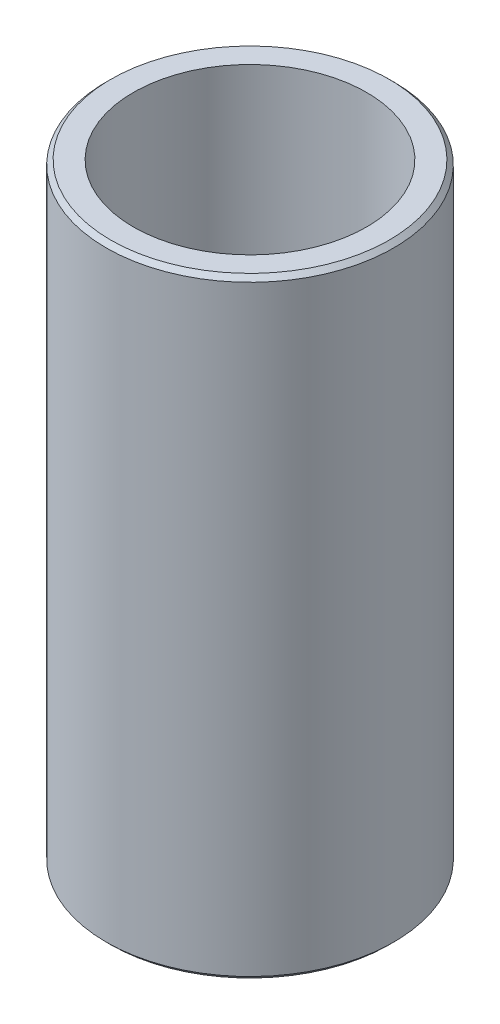
ISO-10303-21;
HEADER;
FILE_DESCRIPTION(('STEP AP214'),'2;1');
FILE_NAME('part.step','',(''),(''),'','','');
FILE_SCHEMA(('AUTOMOTIVE_DESIGN { 1 0 10303 214 1 1 1 1 }'));
ENDSEC;
DATA;
#1=APPLICATION_CONTEXT('core data for automotive mechanical design processes');
#2=APPLICATION_PROTOCOL_DEFINITION('international standard','automotive_design',2000,#1);
#3=PRODUCT_CONTEXT('',#1,'mechanical');
#4=PRODUCT('Part','Part','',(#3));
#5=PRODUCT_RELATED_PRODUCT_CATEGORY('part','',(#4));
#6=PRODUCT_DEFINITION_FORMATION('','',#4);
#7=PRODUCT_DEFINITION_CONTEXT('part definition',#1,'design');
#8=PRODUCT_DEFINITION('design','',#6,#7);
#9=PRODUCT_DEFINITION_SHAPE('','',#8);
#10=(LENGTH_UNIT() NAMED_UNIT(*) SI_UNIT(.MILLI.,.METRE.));
#11=(NAMED_UNIT(*) PLANE_ANGLE_UNIT() SI_UNIT($,.RADIAN.));
#12=(NAMED_UNIT(*) SI_UNIT($,.STERADIAN.) SOLID_ANGLE_UNIT());
#13=UNCERTAINTY_MEASURE_WITH_UNIT(LENGTH_MEASURE(1.E-05),#10,'distance_accuracy_value','');
#14=(GEOMETRIC_REPRESENTATION_CONTEXT(3) GLOBAL_UNCERTAINTY_ASSIGNED_CONTEXT((#13)) GLOBAL_UNIT_ASSIGNED_CONTEXT((#10,
#11,#12)) REPRESENTATION_CONTEXT('',''));
#15=CARTESIAN_POINT('',(0.,0.,0.));
#16=DIRECTION('',(0.,0.,1.));
#17=DIRECTION('',(1.,0.,0.));
#18=AXIS2_PLACEMENT_3D('',#15,#16,#17);
#19=CARTESIAN_POINT('',(0.,33.7,0.));
#20=DIRECTION('',(0.,1.,0.));
#21=DIRECTION('',(0.,0.,1.));
#22=AXIS2_PLACEMENT_3D('',#19,#20,#21);
#23=PLANE('',#22);
#24=CARTESIAN_POINT('',(0.,33.7,0.));
#25=DIRECTION('',(0.,1.,0.));
#26=DIRECTION('',(0.,0.,1.));
#27=AXIS2_PLACEMENT_3D('',#24,#25,#26);
#28=CIRCLE('',#27,7.69);
#29=CARTESIAN_POINT('',(0.,33.7,7.69));
#30=VERTEX_POINT('',#29);
#31=EDGE_CURVE('E10',#30,#30,#28,.T.);
#32=ORIENTED_EDGE('',*,*,#31,.T.);
#33=EDGE_LOOP('',(#32));
#34=FACE_BOUND('',#33,.T.);
#35=CARTESIAN_POINT('',(0.,33.7,0.));
#36=DIRECTION('',(0.,1.,0.));
#37=DIRECTION('',(0.,0.,1.));
#38=AXIS2_PLACEMENT_3D('',#35,#36,#37);
#39=CIRCLE('',#38,6.44);
#40=CARTESIAN_POINT('',(0.,33.7,6.44));
#41=VERTEX_POINT('',#40);
#42=EDGE_CURVE('E51',#41,#41,#39,.T.);
#43=ORIENTED_EDGE('',*,*,#42,.F.);
#44=EDGE_LOOP('',(#43));
#45=FACE_BOUND('',#44,.T.);
#46=ADVANCED_FACE('F31',(#34,#45),#23,.T.);
#47=CARTESIAN_POINT('',(0.,0.,0.));
#48=DIRECTION('',(0.,1.,0.));
#49=DIRECTION('',(0.,0.,1.));
#50=AXIS2_PLACEMENT_3D('',#47,#48,#49);
#51=PLANE('',#50);
#52=CARTESIAN_POINT('',(0.,0.,0.));
#53=DIRECTION('',(0.,1.,0.));
#54=DIRECTION('',(0.,0.,1.));
#55=AXIS2_PLACEMENT_3D('',#52,#53,#54);
#56=CIRCLE('',#55,7.69);
#57=CARTESIAN_POINT('',(0.,0.,7.69));
#58=VERTEX_POINT('',#57);
#59=EDGE_CURVE('E38',#58,#58,#56,.F.);
#60=ORIENTED_EDGE('',*,*,#59,.T.);
#61=EDGE_LOOP('',(#60));
#62=FACE_BOUND('',#61,.T.);
#63=CARTESIAN_POINT('',(0.,0.,0.));
#64=DIRECTION('',(0.,1.,0.));
#65=DIRECTION('',(0.,0.,1.));
#66=AXIS2_PLACEMENT_3D('',#63,#64,#65);
#67=CIRCLE('',#66,6.44);
#68=CARTESIAN_POINT('',(0.,0.,6.44));
#69=VERTEX_POINT('',#68);
#70=EDGE_CURVE('E52',#69,#69,#67,.T.);
#71=ORIENTED_EDGE('',*,*,#70,.T.);
#72=EDGE_LOOP('',(#71));
#73=FACE_BOUND('',#72,.T.);
#74=ADVANCED_FACE('F62',(#62,#73),#51,.F.);
#75=CARTESIAN_POINT('',(0.,33.7,0.));
#76=DIRECTION('',(0.,-1.,0.));
#77=DIRECTION('',(0.,0.,-1.));
#78=AXIS2_PLACEMENT_3D('',#75,#76,#77);
#79=CYLINDRICAL_SURFACE('',#78,7.94);
#80=CARTESIAN_POINT('',(0.,0.250000000000007,0.));
#81=DIRECTION('',(0.,1.,0.));
#82=DIRECTION('',(0.,0.,1.));
#83=AXIS2_PLACEMENT_3D('',#80,#81,#82);
#84=CIRCLE('',#83,7.94);
#85=CARTESIAN_POINT('',(0.,0.250000000000007,7.94));
#86=VERTEX_POINT('',#85);
#87=EDGE_CURVE('E42',#86,#86,#84,.T.);
#88=ORIENTED_EDGE('',*,*,#87,.T.);
#89=EDGE_LOOP('',(#88));
#90=FACE_BOUND('',#89,.T.);
#91=CARTESIAN_POINT('',(0.,33.45,0.));
#92=DIRECTION('',(0.,1.,0.));
#93=DIRECTION('',(0.,0.,1.));
#94=AXIS2_PLACEMENT_3D('',#91,#92,#93);
#95=CIRCLE('',#94,7.94);
#96=CARTESIAN_POINT('',(0.,33.45,7.94));
#97=VERTEX_POINT('',#96);
#98=EDGE_CURVE('E46',#97,#97,#95,.F.);
#99=ORIENTED_EDGE('',*,*,#98,.T.);
#100=EDGE_LOOP('',(#99));
#101=FACE_BOUND('',#100,.T.);
#102=ADVANCED_FACE('F67',(#90,#101),#79,.T.);
#103=CARTESIAN_POINT('',(0.,33.7,0.));
#104=DIRECTION('',(0.,-1.,0.));
#105=DIRECTION('',(0.,0.,-1.));
#106=AXIS2_PLACEMENT_3D('',#103,#104,#105);
#107=CYLINDRICAL_SURFACE('',#106,6.44);
#108=ORIENTED_EDGE('',*,*,#42,.T.);
#109=EDGE_LOOP('',(#108));
#110=FACE_BOUND('',#109,.T.);
#111=ORIENTED_EDGE('',*,*,#70,.F.);
#112=EDGE_LOOP('',(#111));
#113=FACE_BOUND('',#112,.T.);
#114=ADVANCED_FACE('F58',(#110,#113),#107,.F.);
#115=CARTESIAN_POINT('',(0.,0.250000000000007,0.));
#116=DIRECTION('',(0.,1.,0.));
#117=DIRECTION('',(0.,0.,1.));
#118=AXIS2_PLACEMENT_3D('',#115,#116,#117);
#119=CONICAL_SURFACE('',#118,7.94,0.785398163397445);
#120=ORIENTED_EDGE('',*,*,#59,.F.);
#121=EDGE_LOOP('',(#120));
#122=FACE_BOUND('',#121,.T.);
#123=ORIENTED_EDGE('',*,*,#87,.F.);
#124=EDGE_LOOP('',(#123));
#125=FACE_BOUND('',#124,.T.);
#126=ADVANCED_FACE('F73',(#122,#125),#119,.T.);
#127=CARTESIAN_POINT('',(0.,33.7,0.));
#128=DIRECTION('',(0.,-1.,0.));
#129=DIRECTION('',(0.,0.,-1.));
#130=AXIS2_PLACEMENT_3D('',#127,#128,#129);
#131=CONICAL_SURFACE('',#130,7.69,0.785398163397431);
#132=ORIENTED_EDGE('',*,*,#98,.F.);
#133=EDGE_LOOP('',(#132));
#134=FACE_BOUND('',#133,.T.);
#135=ORIENTED_EDGE('',*,*,#31,.F.);
#136=EDGE_LOOP('',(#135));
#137=FACE_BOUND('',#136,.T.);
#138=ADVANCED_FACE('F33',(#134,#137),#131,.T.);
#139=CLOSED_SHELL('',(#46,#74,#102,#114,#126,#138));
#140=MANIFOLD_SOLID_BREP('B2',#139);
#141=ADVANCED_BREP_SHAPE_REPRESENTATION('',(#18,#140),#14);
#142=SHAPE_DEFINITION_REPRESENTATION(#9,#141);
ENDSEC;
END-ISO-10303-21;
